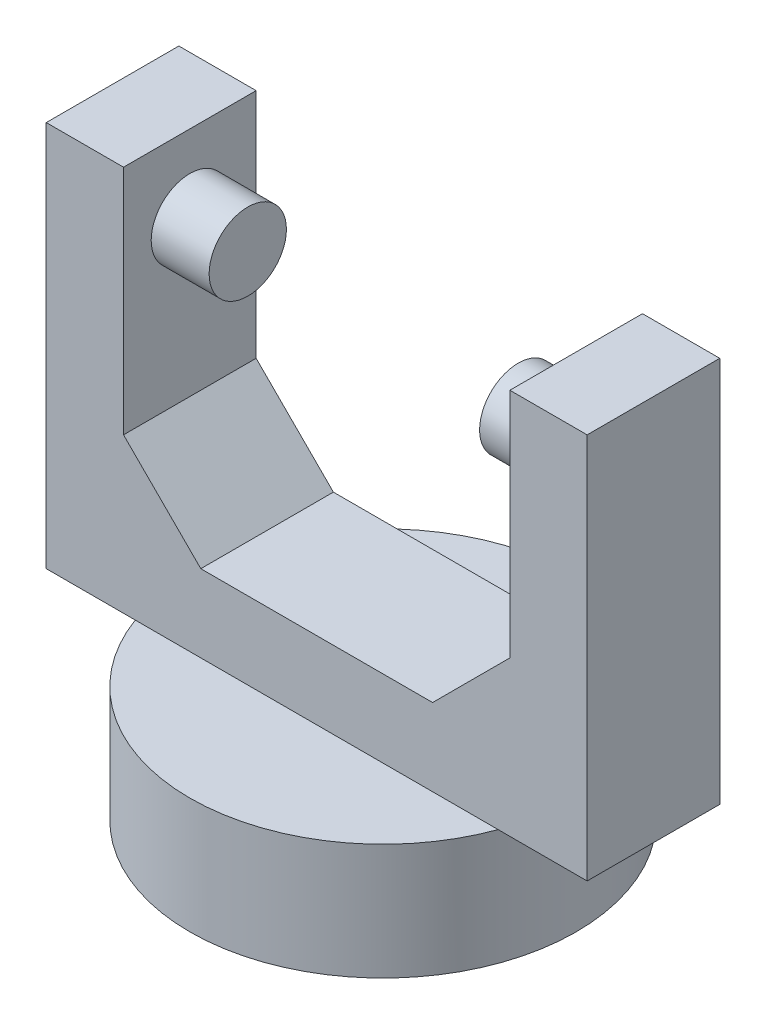
ISO-10303-21;
HEADER;
FILE_DESCRIPTION(('STEP AP214'),'2;1');
FILE_NAME('part.step','',(''),(''),'','','');
FILE_SCHEMA(('AUTOMOTIVE_DESIGN { 1 0 10303 214 1 1 1 1 }'));
ENDSEC;
DATA;
#1=APPLICATION_CONTEXT('core data for automotive mechanical design processes');
#2=APPLICATION_PROTOCOL_DEFINITION('international standard','automotive_design',2000,#1);
#3=PRODUCT_CONTEXT('',#1,'mechanical');
#4=PRODUCT('Part','Part','',(#3));
#5=PRODUCT_RELATED_PRODUCT_CATEGORY('part','',(#4));
#6=PRODUCT_DEFINITION_FORMATION('','',#4);
#7=PRODUCT_DEFINITION_CONTEXT('part definition',#1,'design');
#8=PRODUCT_DEFINITION('design','',#6,#7);
#9=PRODUCT_DEFINITION_SHAPE('','',#8);
#10=(LENGTH_UNIT() NAMED_UNIT(*) SI_UNIT(.MILLI.,.METRE.));
#11=(NAMED_UNIT(*) PLANE_ANGLE_UNIT() SI_UNIT($,.RADIAN.));
#12=(NAMED_UNIT(*) SI_UNIT($,.STERADIAN.) SOLID_ANGLE_UNIT());
#13=UNCERTAINTY_MEASURE_WITH_UNIT(LENGTH_MEASURE(1.E-05),#10,'distance_accuracy_value','');
#14=(GEOMETRIC_REPRESENTATION_CONTEXT(3) GLOBAL_UNCERTAINTY_ASSIGNED_CONTEXT((#13)) GLOBAL_UNIT_ASSIGNED_CONTEXT((#10,
#11,#12)) REPRESENTATION_CONTEXT('',''));
#15=CARTESIAN_POINT('',(0.,0.,0.));
#16=DIRECTION('',(0.,0.,1.));
#17=DIRECTION('',(1.,0.,0.));
#18=AXIS2_PLACEMENT_3D('',#15,#16,#17);
#19=CARTESIAN_POINT('',(0.,32.5,0.));
#20=DIRECTION('',(0.,1.,0.));
#21=DIRECTION('',(0.,0.,1.));
#22=AXIS2_PLACEMENT_3D('',#19,#20,#21);
#23=PLANE('',#22);
#24=DIRECTION('',(0.,0.,1.));
#25=VECTOR('',#24,1.);
#26=CARTESIAN_POINT('',(-12.5,32.5,-4.29038395748194));
#27=LINE('',#26,#25);
#28=CARTESIAN_POINT('',(-12.5,32.5,-4.29038395748194));
#29=VERTEX_POINT('',#28);
#30=CARTESIAN_POINT('',(-12.5,32.5,4.29038395748193));
#31=VERTEX_POINT('',#30);
#32=EDGE_CURVE('E142',#29,#31,#27,.T.);
#33=ORIENTED_EDGE('',*,*,#32,.F.);
#34=DIRECTION('',(-1.,0.,0.));
#35=VECTOR('',#34,1.);
#36=CARTESIAN_POINT('',(-17.5,32.5,-4.29038395748194));
#37=LINE('',#36,#35);
#38=CARTESIAN_POINT('',(-17.5,32.5,-4.29038395748194));
#39=VERTEX_POINT('',#38);
#40=EDGE_CURVE('E161',#29,#39,#37,.T.);
#41=ORIENTED_EDGE('',*,*,#40,.T.);
#42=DIRECTION('',(0.,0.,1.));
#43=VECTOR('',#42,1.);
#44=CARTESIAN_POINT('',(-17.5,32.5,-4.29038395748194));
#45=LINE('',#44,#43);
#46=CARTESIAN_POINT('',(-17.5,32.5,4.29038395748193));
#47=VERTEX_POINT('',#46);
#48=EDGE_CURVE('E153',#39,#47,#45,.T.);
#49=ORIENTED_EDGE('',*,*,#48,.T.);
#50=DIRECTION('',(1.,0.,0.));
#51=VECTOR('',#50,1.);
#52=CARTESIAN_POINT('',(-17.5,32.5,4.29038395748193));
#53=LINE('',#52,#51);
#54=EDGE_CURVE('E132',#47,#31,#53,.T.);
#55=ORIENTED_EDGE('',*,*,#54,.T.);
#56=EDGE_LOOP('',(#33,#41,#49,#55));
#57=FACE_BOUND('',#56,.T.);
#58=ADVANCED_FACE('F39',(#57),#23,.T.);
#59=CARTESIAN_POINT('',(0.,7.5,0.));
#60=DIRECTION('',(0.,1.,0.));
#61=DIRECTION('',(0.,0.,1.));
#62=AXIS2_PLACEMENT_3D('',#59,#60,#61);
#63=PLANE('',#62);
#64=DIRECTION('',(-1.,0.,0.));
#65=VECTOR('',#64,1.);
#66=CARTESIAN_POINT('',(-17.5,7.5,-4.29038395748194));
#67=LINE('',#66,#65);
#68=CARTESIAN_POINT('',(11.7406390583044,7.5,-4.29038395748194));
#69=VERTEX_POINT('',#68);
#70=CARTESIAN_POINT('',(-11.7406390583044,7.5,-4.29038395748194));
#71=VERTEX_POINT('',#70);
#72=EDGE_CURVE('E188',#69,#71,#67,.T.);
#73=ORIENTED_EDGE('',*,*,#72,.F.);
#74=CARTESIAN_POINT('',(0.,7.5,0.));
#75=DIRECTION('',(0.,1.,0.));
#76=DIRECTION('',(0.,0.,1.));
#77=AXIS2_PLACEMENT_3D('',#74,#75,#76);
#78=CIRCLE('',#77,12.5);
#79=EDGE_CURVE('E208',#69,#71,#78,.T.);
#80=ORIENTED_EDGE('',*,*,#79,.T.);
#81=EDGE_LOOP('',(#73,#80));
#82=FACE_BOUND('',#81,.T.);
#83=ADVANCED_FACE('F318',(#82),#63,.T.);
#84=CARTESIAN_POINT('',(0.,7.5,0.));
#85=DIRECTION('',(0.,-1.,0.));
#86=DIRECTION('',(0.,0.,-1.));
#87=AXIS2_PLACEMENT_3D('',#84,#85,#86);
#88=CYLINDRICAL_SURFACE('',#87,12.5);
#89=CARTESIAN_POINT('',(11.7406390583043,7.5,4.29038395748194));
#90=VERTEX_POINT('',#89);
#91=EDGE_CURVE('E204',#90,#69,#78,.T.);
#92=ORIENTED_EDGE('',*,*,#91,.F.);
#93=CARTESIAN_POINT('',(-11.7406390583044,7.5,4.29038395748193));
#94=VERTEX_POINT('',#93);
#95=EDGE_CURVE('E209',#94,#90,#78,.T.);
#96=ORIENTED_EDGE('',*,*,#95,.F.);
#97=EDGE_CURVE('E247',#71,#94,#78,.T.);
#98=ORIENTED_EDGE('',*,*,#97,.F.);
#99=ORIENTED_EDGE('',*,*,#79,.F.);
#100=EDGE_LOOP('',(#92,#96,#98,#99));
#101=FACE_BOUND('',#100,.T.);
#102=CARTESIAN_POINT('',(0.,0.,0.));
#103=DIRECTION('',(0.,1.,0.));
#104=DIRECTION('',(0.,0.,1.));
#105=AXIS2_PLACEMENT_3D('',#102,#103,#104);
#106=CIRCLE('',#105,12.5);
#107=CARTESIAN_POINT('',(0.,0.,12.5));
#108=VERTEX_POINT('',#107);
#109=EDGE_CURVE('E203',#108,#108,#106,.T.);
#110=ORIENTED_EDGE('',*,*,#109,.T.);
#111=EDGE_LOOP('',(#110));
#112=FACE_BOUND('',#111,.T.);
#113=ADVANCED_FACE('F324',(#101,#112),#88,.T.);
#114=DIRECTION('',(1.,0.,0.));
#115=VECTOR('',#114,1.);
#116=CARTESIAN_POINT('',(-17.5,7.5,4.29038395748193));
#117=LINE('',#116,#115);
#118=EDGE_CURVE('E180',#94,#90,#117,.T.);
#119=ORIENTED_EDGE('',*,*,#118,.F.);
#120=ORIENTED_EDGE('',*,*,#95,.T.);
#121=EDGE_LOOP('',(#119,#120));
#122=FACE_BOUND('',#121,.T.);
#123=ADVANCED_FACE('F327',(#122),#63,.T.);
#124=CARTESIAN_POINT('',(0.,0.,0.));
#125=DIRECTION('',(0.,1.,0.));
#126=DIRECTION('',(0.,0.,1.));
#127=AXIS2_PLACEMENT_3D('',#124,#125,#126);
#128=PLANE('',#127);
#129=ORIENTED_EDGE('',*,*,#109,.F.);
#130=EDGE_LOOP('',(#129));
#131=FACE_BOUND('',#130,.T.);
#132=ADVANCED_FACE('F361',(#131),#128,.F.);
#133=CARTESIAN_POINT('',(0.,7.5,0.));
#134=DIRECTION('',(0.,1.,0.));
#135=DIRECTION('',(0.,0.,1.));
#136=AXIS2_PLACEMENT_3D('',#133,#134,#135);
#137=PLANE('',#136);
#138=CARTESIAN_POINT('',(17.5,7.5,4.29038395748194));
#139=VERTEX_POINT('',#138);
#140=EDGE_CURVE('E174',#90,#139,#117,.T.);
#141=ORIENTED_EDGE('',*,*,#140,.F.);
#142=ORIENTED_EDGE('',*,*,#91,.T.);
#143=CARTESIAN_POINT('',(17.5,7.5,-4.29038395748194));
#144=VERTEX_POINT('',#143);
#145=EDGE_CURVE('E184',#144,#69,#67,.T.);
#146=ORIENTED_EDGE('',*,*,#145,.F.);
#147=DIRECTION('',(0.,0.,-1.));
#148=VECTOR('',#147,1.);
#149=CARTESIAN_POINT('',(17.5,7.5,-4.29038395748194));
#150=LINE('',#149,#148);
#151=EDGE_CURVE('E179',#139,#144,#150,.T.);
#152=ORIENTED_EDGE('',*,*,#151,.F.);
#153=EDGE_LOOP('',(#141,#142,#146,#152));
#154=FACE_BOUND('',#153,.T.);
#155=ADVANCED_FACE('F347',(#154),#137,.F.);
#156=CARTESIAN_POINT('',(-17.5,7.5,-4.29038395748194));
#157=VERTEX_POINT('',#156);
#158=EDGE_CURVE('E183',#71,#157,#67,.T.);
#159=ORIENTED_EDGE('',*,*,#158,.F.);
#160=ORIENTED_EDGE('',*,*,#97,.T.);
#161=CARTESIAN_POINT('',(-17.5,7.5,4.29038395748193));
#162=VERTEX_POINT('',#161);
#163=EDGE_CURVE('E175',#162,#94,#117,.T.);
#164=ORIENTED_EDGE('',*,*,#163,.F.);
#165=DIRECTION('',(0.,0.,1.));
#166=VECTOR('',#165,1.);
#167=CARTESIAN_POINT('',(-17.5,7.5,-4.29038395748194));
#168=LINE('',#167,#166);
#169=EDGE_CURVE('E170',#157,#162,#168,.T.);
#170=ORIENTED_EDGE('',*,*,#169,.F.);
#171=EDGE_LOOP('',(#159,#160,#164,#170));
#172=FACE_BOUND('',#171,.T.);
#173=ADVANCED_FACE('F354',(#172),#137,.F.);
#174=CARTESIAN_POINT('',(-17.5,32.5,-4.29038395748194));
#175=DIRECTION('',(1.,0.,0.));
#176=DIRECTION('',(0.,0.,-1.));
#177=AXIS2_PLACEMENT_3D('',#174,#175,#176);
#178=PLANE('',#177);
#179=ORIENTED_EDGE('',*,*,#169,.T.);
#180=DIRECTION('',(0.,-1.,0.));
#181=VECTOR('',#180,1.);
#182=CARTESIAN_POINT('',(-17.5,32.5,4.29038395748193));
#183=LINE('',#182,#181);
#184=EDGE_CURVE('E200',#47,#162,#183,.T.);
#185=ORIENTED_EDGE('',*,*,#184,.F.);
#186=ORIENTED_EDGE('',*,*,#48,.F.);
#187=DIRECTION('',(0.,-1.,0.));
#188=VECTOR('',#187,1.);
#189=CARTESIAN_POINT('',(-17.5,32.5,-4.29038395748194));
#190=LINE('',#189,#188);
#191=EDGE_CURVE('E169',#39,#157,#190,.T.);
#192=ORIENTED_EDGE('',*,*,#191,.T.);
#193=EDGE_LOOP('',(#179,#185,#186,#192));
#194=FACE_BOUND('',#193,.T.);
#195=ADVANCED_FACE('F257',(#194),#178,.F.);
#196=CARTESIAN_POINT('',(-17.5,32.5,4.29038395748193));
#197=DIRECTION('',(0.,0.,-1.));
#198=DIRECTION('',(-1.,0.,0.));
#199=AXIS2_PLACEMENT_3D('',#196,#197,#198);
#200=PLANE('',#199);
#201=DIRECTION('',(1.,0.,0.));
#202=VECTOR('',#201,1.);
#203=CARTESIAN_POINT('',(-12.5,12.5,4.29038395748193));
#204=LINE('',#203,#202);
#205=CARTESIAN_POINT('',(-7.49999999999997,12.5,4.29038395748193));
#206=VERTEX_POINT('',#205);
#207=CARTESIAN_POINT('',(7.49999999999997,12.5,4.29038395748193));
#208=VERTEX_POINT('',#207);
#209=EDGE_CURVE('E270',#206,#208,#204,.T.);
#210=ORIENTED_EDGE('',*,*,#209,.F.);
#211=DIRECTION('',(-0.707106781186551,0.707106781186544,0.));
#212=VECTOR('',#211,1.);
#213=CARTESIAN_POINT('',(-22.5,27.4999999999999,4.29038395748193));
#214=LINE('',#213,#212);
#215=CARTESIAN_POINT('',(-12.5,17.5,4.29038395748193));
#216=VERTEX_POINT('',#215);
#217=EDGE_CURVE('E134',#206,#216,#214,.T.);
#218=ORIENTED_EDGE('',*,*,#217,.T.);
#219=DIRECTION('',(0.,1.,0.));
#220=VECTOR('',#219,1.);
#221=CARTESIAN_POINT('',(-12.5,12.5,4.29038395748193));
#222=LINE('',#221,#220);
#223=EDGE_CURVE('E126',#216,#31,#222,.T.);
#224=ORIENTED_EDGE('',*,*,#223,.T.);
#225=ORIENTED_EDGE('',*,*,#54,.F.);
#226=ORIENTED_EDGE('',*,*,#184,.T.);
#227=ORIENTED_EDGE('',*,*,#163,.T.);
#228=ORIENTED_EDGE('',*,*,#118,.T.);
#229=ORIENTED_EDGE('',*,*,#140,.T.);
#230=DIRECTION('',(0.,-1.,0.));
#231=VECTOR('',#230,1.);
#232=CARTESIAN_POINT('',(17.5,32.5,4.29038395748194));
#233=LINE('',#232,#231);
#234=CARTESIAN_POINT('',(17.5,32.5,4.29038395748194));
#235=VERTEX_POINT('',#234);
#236=EDGE_CURVE('E196',#235,#139,#233,.T.);
#237=ORIENTED_EDGE('',*,*,#236,.F.);
#238=CARTESIAN_POINT('',(12.5,32.5,4.29038395748194));
#239=VERTEX_POINT('',#238);
#240=EDGE_CURVE('E157',#239,#235,#53,.T.);
#241=ORIENTED_EDGE('',*,*,#240,.F.);
#242=DIRECTION('',(0.,1.,0.));
#243=VECTOR('',#242,1.);
#244=CARTESIAN_POINT('',(12.5,12.5,4.29038395748193));
#245=LINE('',#244,#243);
#246=CARTESIAN_POINT('',(12.5,17.5,4.29038395748193));
#247=VERTEX_POINT('',#246);
#248=EDGE_CURVE('E138',#247,#239,#245,.T.);
#249=ORIENTED_EDGE('',*,*,#248,.F.);
#250=DIRECTION('',(-0.707106781186551,-0.707106781186544,0.));
#251=VECTOR('',#250,1.);
#252=CARTESIAN_POINT('',(4.99999999999987,9.99999999999991,4.29038395748193));
#253=LINE('',#252,#251);
#254=EDGE_CURVE('E11',#247,#208,#253,.T.);
#255=ORIENTED_EDGE('',*,*,#254,.T.);
#256=EDGE_LOOP('',(#210,#218,#224,#225,#226,#227,#228,#229,#237,#241,#249,#255));
#257=FACE_BOUND('',#256,.T.);
#258=ADVANCED_FACE('F129',(#257),#200,.F.);
#259=CARTESIAN_POINT('',(17.5,32.5,-4.29038395748194));
#260=DIRECTION('',(-1.,0.,0.));
#261=DIRECTION('',(0.,0.,1.));
#262=AXIS2_PLACEMENT_3D('',#259,#260,#261);
#263=PLANE('',#262);
#264=ORIENTED_EDGE('',*,*,#151,.T.);
#265=DIRECTION('',(0.,-1.,0.));
#266=VECTOR('',#265,1.);
#267=CARTESIAN_POINT('',(17.5,32.5,-4.29038395748194));
#268=LINE('',#267,#266);
#269=CARTESIAN_POINT('',(17.5,32.5,-4.29038395748194));
#270=VERTEX_POINT('',#269);
#271=EDGE_CURVE('E192',#270,#144,#268,.T.);
#272=ORIENTED_EDGE('',*,*,#271,.F.);
#273=DIRECTION('',(0.,0.,-1.));
#274=VECTOR('',#273,1.);
#275=CARTESIAN_POINT('',(17.5,32.5,-4.29038395748194));
#276=LINE('',#275,#274);
#277=EDGE_CURVE('E156',#235,#270,#276,.T.);
#278=ORIENTED_EDGE('',*,*,#277,.F.);
#279=ORIENTED_EDGE('',*,*,#236,.T.);
#280=EDGE_LOOP('',(#264,#272,#278,#279));
#281=FACE_BOUND('',#280,.T.);
#282=ADVANCED_FACE('F337',(#281),#263,.F.);
#283=CARTESIAN_POINT('',(-17.5,32.5,-4.29038395748194));
#284=DIRECTION('',(0.,0.,1.));
#285=DIRECTION('',(1.,0.,0.));
#286=AXIS2_PLACEMENT_3D('',#283,#284,#285);
#287=PLANE('',#286);
#288=ORIENTED_EDGE('',*,*,#40,.F.);
#289=DIRECTION('',(0.,1.,0.));
#290=VECTOR('',#289,1.);
#291=CARTESIAN_POINT('',(-12.5,12.5,-4.29038395748194));
#292=LINE('',#291,#290);
#293=CARTESIAN_POINT('',(-12.5,17.5,-4.29038395748194));
#294=VERTEX_POINT('',#293);
#295=EDGE_CURVE('E145',#294,#29,#292,.T.);
#296=ORIENTED_EDGE('',*,*,#295,.F.);
#297=DIRECTION('',(0.707106781186551,-0.707106781186544,0.));
#298=VECTOR('',#297,1.);
#299=CARTESIAN_POINT('',(-22.5,27.4999999999999,-4.29038395748194));
#300=LINE('',#299,#298);
#301=CARTESIAN_POINT('',(-7.49999999999997,12.5,-4.29038395748194));
#302=VERTEX_POINT('',#301);
#303=EDGE_CURVE('E230',#294,#302,#300,.T.);
#304=ORIENTED_EDGE('',*,*,#303,.T.);
#305=DIRECTION('',(-1.,0.,0.));
#306=VECTOR('',#305,1.);
#307=CARTESIAN_POINT('',(-12.5,12.5,-4.29038395748194));
#308=LINE('',#307,#306);
#309=CARTESIAN_POINT('',(7.49999999999996,12.5,-4.29038395748194));
#310=VERTEX_POINT('',#309);
#311=EDGE_CURVE('E139',#310,#302,#308,.T.);
#312=ORIENTED_EDGE('',*,*,#311,.F.);
#313=DIRECTION('',(0.707106781186551,0.707106781186544,0.));
#314=VECTOR('',#313,1.);
#315=CARTESIAN_POINT('',(4.99999999999987,9.99999999999991,-4.29038395748194));
#316=LINE('',#315,#314);
#317=CARTESIAN_POINT('',(12.5,17.5,-4.29038395748194));
#318=VERTEX_POINT('',#317);
#319=EDGE_CURVE('E48',#310,#318,#316,.T.);
#320=ORIENTED_EDGE('',*,*,#319,.T.);
#321=DIRECTION('',(0.,1.,0.));
#322=VECTOR('',#321,1.);
#323=CARTESIAN_POINT('',(12.5,12.5,-4.29038395748194));
#324=LINE('',#323,#322);
#325=CARTESIAN_POINT('',(12.5,32.5,-4.29038395748194));
#326=VERTEX_POINT('',#325);
#327=EDGE_CURVE('E263',#318,#326,#324,.T.);
#328=ORIENTED_EDGE('',*,*,#327,.T.);
#329=EDGE_CURVE('E165',#270,#326,#37,.T.);
#330=ORIENTED_EDGE('',*,*,#329,.F.);
#331=ORIENTED_EDGE('',*,*,#271,.T.);
#332=ORIENTED_EDGE('',*,*,#145,.T.);
#333=ORIENTED_EDGE('',*,*,#72,.T.);
#334=ORIENTED_EDGE('',*,*,#158,.T.);
#335=ORIENTED_EDGE('',*,*,#191,.F.);
#336=EDGE_LOOP('',(#288,#296,#304,#312,#320,#328,#330,#331,#332,#333,#334,#335));
#337=FACE_BOUND('',#336,.T.);
#338=ADVANCED_FACE('F253',(#337),#287,.F.);
#339=DIRECTION('',(0.,0.,-1.));
#340=VECTOR('',#339,1.);
#341=CARTESIAN_POINT('',(12.5,32.5,-4.29038395748194));
#342=LINE('',#341,#340);
#343=EDGE_CURVE('E149',#239,#326,#342,.T.);
#344=ORIENTED_EDGE('',*,*,#343,.F.);
#345=ORIENTED_EDGE('',*,*,#240,.T.);
#346=ORIENTED_EDGE('',*,*,#277,.T.);
#347=ORIENTED_EDGE('',*,*,#329,.T.);
#348=EDGE_LOOP('',(#344,#345,#346,#347));
#349=FACE_BOUND('',#348,.T.);
#350=ADVANCED_FACE('F320',(#349),#23,.T.);
#351=CARTESIAN_POINT('',(-12.5,12.5,-4.29038395748194));
#352=DIRECTION('',(-1.,0.,0.));
#353=DIRECTION('',(0.,0.,1.));
#354=AXIS2_PLACEMENT_3D('',#351,#352,#353);
#355=PLANE('',#354);
#356=CARTESIAN_POINT('',(-12.5,27.5,0.));
#357=DIRECTION('',(-1.,0.,0.));
#358=DIRECTION('',(0.,0.,1.));
#359=AXIS2_PLACEMENT_3D('',#356,#357,#358);
#360=CIRCLE('',#359,2.5);
#361=CARTESIAN_POINT('',(-12.5,27.5,2.5));
#362=VERTEX_POINT('',#361);
#363=EDGE_CURVE('E213',#362,#362,#360,.F.);
#364=ORIENTED_EDGE('',*,*,#363,.F.);
#365=EDGE_LOOP('',(#364));
#366=FACE_BOUND('',#365,.T.);
#367=ORIENTED_EDGE('',*,*,#223,.F.);
#368=DIRECTION('',(0.,0.,-1.));
#369=VECTOR('',#368,1.);
#370=CARTESIAN_POINT('',(-12.5,17.5,-4.29038395748194));
#371=LINE('',#370,#369);
#372=EDGE_CURVE('E225',#216,#294,#371,.T.);
#373=ORIENTED_EDGE('',*,*,#372,.T.);
#374=ORIENTED_EDGE('',*,*,#295,.T.);
#375=ORIENTED_EDGE('',*,*,#32,.T.);
#376=EDGE_LOOP('',(#367,#373,#374,#375));
#377=FACE_BOUND('',#376,.T.);
#378=ADVANCED_FACE('F143',(#366,#377),#355,.F.);
#379=CARTESIAN_POINT('',(12.5,12.5,-4.29038395748194));
#380=DIRECTION('',(1.,0.,0.));
#381=DIRECTION('',(0.,0.,-1.));
#382=AXIS2_PLACEMENT_3D('',#379,#380,#381);
#383=PLANE('',#382);
#384=CARTESIAN_POINT('',(12.5,27.5,0.));
#385=DIRECTION('',(1.,0.,0.));
#386=DIRECTION('',(0.,0.,-1.));
#387=AXIS2_PLACEMENT_3D('',#384,#385,#386);
#388=CIRCLE('',#387,2.5);
#389=CARTESIAN_POINT('',(12.5,27.5,-2.5));
#390=VERTEX_POINT('',#389);
#391=EDGE_CURVE('E217',#390,#390,#388,.F.);
#392=ORIENTED_EDGE('',*,*,#391,.F.);
#393=EDGE_LOOP('',(#392));
#394=FACE_BOUND('',#393,.T.);
#395=ORIENTED_EDGE('',*,*,#327,.F.);
#396=DIRECTION('',(0.,0.,1.));
#397=VECTOR('',#396,1.);
#398=CARTESIAN_POINT('',(12.5,17.5,-4.29038395748194));
#399=LINE('',#398,#397);
#400=EDGE_CURVE('E55',#318,#247,#399,.T.);
#401=ORIENTED_EDGE('',*,*,#400,.T.);
#402=ORIENTED_EDGE('',*,*,#248,.T.);
#403=ORIENTED_EDGE('',*,*,#343,.T.);
#404=EDGE_LOOP('',(#395,#401,#402,#403));
#405=FACE_BOUND('',#404,.T.);
#406=ADVANCED_FACE('F295',(#394,#405),#383,.F.);
#407=CARTESIAN_POINT('',(0.,12.5,0.));
#408=DIRECTION('',(0.,1.,0.));
#409=DIRECTION('',(0.,0.,1.));
#410=AXIS2_PLACEMENT_3D('',#407,#408,#409);
#411=PLANE('',#410);
#412=ORIENTED_EDGE('',*,*,#209,.T.);
#413=DIRECTION('',(0.,0.,-1.));
#414=VECTOR('',#413,1.);
#415=CARTESIAN_POINT('',(7.49999999999997,12.5,0.));
#416=LINE('',#415,#414);
#417=EDGE_CURVE('E234',#208,#310,#416,.T.);
#418=ORIENTED_EDGE('',*,*,#417,.T.);
#419=ORIENTED_EDGE('',*,*,#311,.T.);
#420=DIRECTION('',(0.,0.,1.));
#421=VECTOR('',#420,1.);
#422=CARTESIAN_POINT('',(-7.49999999999997,12.5,0.));
#423=LINE('',#422,#421);
#424=EDGE_CURVE('E221',#302,#206,#423,.T.);
#425=ORIENTED_EDGE('',*,*,#424,.T.);
#426=EDGE_LOOP('',(#412,#418,#419,#425));
#427=FACE_BOUND('',#426,.T.);
#428=ADVANCED_FACE('F297',(#427),#411,.T.);
#429=CARTESIAN_POINT('',(-8.75,27.5,0.));
#430=DIRECTION('',(-1.,0.,0.));
#431=DIRECTION('',(0.,0.,1.));
#432=AXIS2_PLACEMENT_3D('',#429,#430,#431);
#433=CYLINDRICAL_SURFACE('',#432,2.5);
#434=CARTESIAN_POINT('',(-8.75,27.5,0.));
#435=DIRECTION('',(1.,0.,0.));
#436=DIRECTION('',(0.,0.,-1.));
#437=AXIS2_PLACEMENT_3D('',#434,#435,#436);
#438=CIRCLE('',#437,2.5);
#439=CARTESIAN_POINT('',(-8.75,27.5,-2.5));
#440=VERTEX_POINT('',#439);
#441=EDGE_CURVE('E150',#440,#440,#438,.T.);
#442=ORIENTED_EDGE('',*,*,#441,.F.);
#443=EDGE_LOOP('',(#442));
#444=FACE_BOUND('',#443,.T.);
#445=ORIENTED_EDGE('',*,*,#363,.T.);
#446=EDGE_LOOP('',(#445));
#447=FACE_BOUND('',#446,.T.);
#448=ADVANCED_FACE('F420',(#444,#447),#433,.T.);
#449=CARTESIAN_POINT('',(-8.75,27.5,0.));
#450=DIRECTION('',(1.,0.,0.));
#451=DIRECTION('',(0.,0.,-1.));
#452=AXIS2_PLACEMENT_3D('',#449,#450,#451);
#453=PLANE('',#452);
#454=ORIENTED_EDGE('',*,*,#441,.T.);
#455=EDGE_LOOP('',(#454));
#456=FACE_BOUND('',#455,.T.);
#457=ADVANCED_FACE('F291',(#456),#453,.T.);
#458=CARTESIAN_POINT('',(8.75,27.5,0.));
#459=DIRECTION('',(1.,0.,0.));
#460=DIRECTION('',(0.,0.,-1.));
#461=AXIS2_PLACEMENT_3D('',#458,#459,#460);
#462=CYLINDRICAL_SURFACE('',#461,2.5);
#463=CARTESIAN_POINT('',(8.75,27.5,0.));
#464=DIRECTION('',(-1.,0.,0.));
#465=DIRECTION('',(0.,0.,1.));
#466=AXIS2_PLACEMENT_3D('',#463,#464,#465);
#467=CIRCLE('',#466,2.5);
#468=CARTESIAN_POINT('',(8.75,27.5,2.5));
#469=VERTEX_POINT('',#468);
#470=EDGE_CURVE('E280',#469,#469,#467,.T.);
#471=ORIENTED_EDGE('',*,*,#470,.F.);
#472=EDGE_LOOP('',(#471));
#473=FACE_BOUND('',#472,.T.);
#474=ORIENTED_EDGE('',*,*,#391,.T.);
#475=EDGE_LOOP('',(#474));
#476=FACE_BOUND('',#475,.T.);
#477=ADVANCED_FACE('F288',(#473,#476),#462,.T.);
#478=CARTESIAN_POINT('',(8.75,27.5,0.));
#479=DIRECTION('',(-1.,0.,0.));
#480=DIRECTION('',(0.,0.,1.));
#481=AXIS2_PLACEMENT_3D('',#478,#479,#480);
#482=PLANE('',#481);
#483=ORIENTED_EDGE('',*,*,#470,.T.);
#484=EDGE_LOOP('',(#483));
#485=FACE_BOUND('',#484,.T.);
#486=ADVANCED_FACE('F286',(#485),#482,.T.);
#487=CARTESIAN_POINT('',(-7.49999999999997,12.5,0.));
#488=DIRECTION('',(-0.707106781186544,-0.707106781186551,0.));
#489=DIRECTION('',(0.,0.,1.));
#490=AXIS2_PLACEMENT_3D('',#487,#488,#489);
#491=PLANE('',#490);
#492=ORIENTED_EDGE('',*,*,#303,.F.);
#493=ORIENTED_EDGE('',*,*,#372,.F.);
#494=ORIENTED_EDGE('',*,*,#217,.F.);
#495=ORIENTED_EDGE('',*,*,#424,.F.);
#496=EDGE_LOOP('',(#492,#493,#494,#495));
#497=FACE_BOUND('',#496,.T.);
#498=ADVANCED_FACE('F309',(#497),#491,.F.);
#499=CARTESIAN_POINT('',(7.49999999999997,12.5,0.));
#500=DIRECTION('',(0.707106781186544,-0.707106781186551,0.));
#501=DIRECTION('',(0.,0.,-1.));
#502=AXIS2_PLACEMENT_3D('',#499,#500,#501);
#503=PLANE('',#502);
#504=ORIENTED_EDGE('',*,*,#254,.F.);
#505=ORIENTED_EDGE('',*,*,#400,.F.);
#506=ORIENTED_EDGE('',*,*,#319,.F.);
#507=ORIENTED_EDGE('',*,*,#417,.F.);
#508=EDGE_LOOP('',(#504,#505,#506,#507));
#509=FACE_BOUND('',#508,.T.);
#510=ADVANCED_FACE('F41',(#509),#503,.F.);
#511=CLOSED_SHELL('',(#58,#83,#113,#123,#132,#155,#173,#195,#258,#282,#338,#350,#378,#406,#428,
#448,#457,#477,#486,#498,#510));
#512=MANIFOLD_SOLID_BREP('B2',#511);
#513=ADVANCED_BREP_SHAPE_REPRESENTATION('',(#18,#512),#14);
#514=SHAPE_DEFINITION_REPRESENTATION(#9,#513);
ENDSEC;
END-ISO-10303-21;
